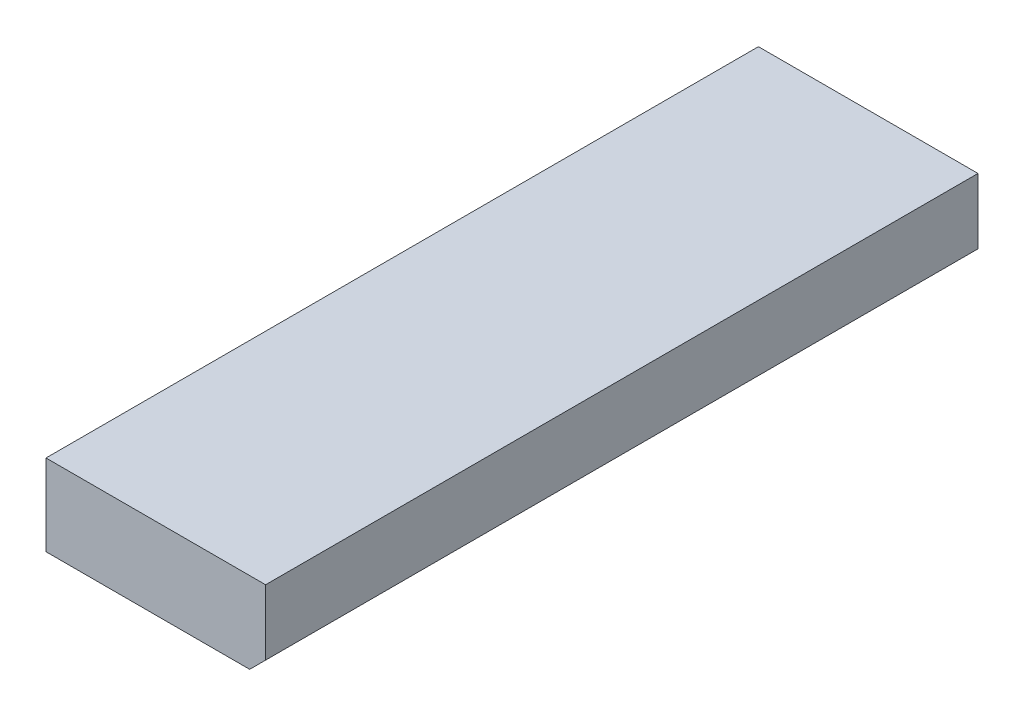
ISO-10303-21;
HEADER;
FILE_DESCRIPTION(('STEP AP214'),'2;1');
FILE_NAME('part.step','',(''),(''),'','','');
FILE_SCHEMA(('AUTOMOTIVE_DESIGN { 1 0 10303 214 1 1 1 1 }'));
ENDSEC;
DATA;
#1=APPLICATION_CONTEXT('core data for automotive mechanical design processes');
#2=APPLICATION_PROTOCOL_DEFINITION('international standard','automotive_design',2000,#1);
#3=PRODUCT_CONTEXT('',#1,'mechanical');
#4=PRODUCT('Part','Part','',(#3));
#5=PRODUCT_RELATED_PRODUCT_CATEGORY('part','',(#4));
#6=PRODUCT_DEFINITION_FORMATION('','',#4);
#7=PRODUCT_DEFINITION_CONTEXT('part definition',#1,'design');
#8=PRODUCT_DEFINITION('design','',#6,#7);
#9=PRODUCT_DEFINITION_SHAPE('','',#8);
#10=(LENGTH_UNIT() NAMED_UNIT(*) SI_UNIT(.MILLI.,.METRE.));
#11=(NAMED_UNIT(*) PLANE_ANGLE_UNIT() SI_UNIT($,.RADIAN.));
#12=(NAMED_UNIT(*) SI_UNIT($,.STERADIAN.) SOLID_ANGLE_UNIT());
#13=UNCERTAINTY_MEASURE_WITH_UNIT(LENGTH_MEASURE(1.E-05),#10,'distance_accuracy_value','');
#14=(GEOMETRIC_REPRESENTATION_CONTEXT(3) GLOBAL_UNCERTAINTY_ASSIGNED_CONTEXT((#13)) GLOBAL_UNIT_ASSIGNED_CONTEXT((#10,
#11,#12)) REPRESENTATION_CONTEXT('',''));
#15=CARTESIAN_POINT('',(0.,0.,0.));
#16=DIRECTION('',(0.,0.,1.));
#17=DIRECTION('',(1.,0.,0.));
#18=AXIS2_PLACEMENT_3D('',#15,#16,#17);
#19=CARTESIAN_POINT('',(0.,0.24375,2.138));
#20=DIRECTION('',(1.,0.,0.));
#21=DIRECTION('',(0.,0.,-1.));
#22=AXIS2_PLACEMENT_3D('',#19,#20,#21);
#23=PLANE('',#22);
#24=DIRECTION('',(0.,-1.,0.));
#25=VECTOR('',#24,1.);
#26=CARTESIAN_POINT('',(0.,0.24375,0.));
#27=LINE('',#26,#25);
#28=CARTESIAN_POINT('',(0.,0.24375,0.));
#29=VERTEX_POINT('',#28);
#30=CARTESIAN_POINT('',(0.,0.,0.));
#31=VERTEX_POINT('',#30);
#32=EDGE_CURVE('E118',#29,#31,#27,.T.);
#33=ORIENTED_EDGE('',*,*,#32,.T.);
#34=DIRECTION('',(0.,0.,-1.));
#35=VECTOR('',#34,1.);
#36=CARTESIAN_POINT('',(0.,0.,2.138));
#37=LINE('',#36,#35);
#38=CARTESIAN_POINT('',(0.,0.,2.138));
#39=VERTEX_POINT('',#38);
#40=EDGE_CURVE('E11',#39,#31,#37,.T.);
#41=ORIENTED_EDGE('',*,*,#40,.F.);
#42=DIRECTION('',(0.,-1.,0.));
#43=VECTOR('',#42,1.);
#44=CARTESIAN_POINT('',(0.,0.24375,2.138));
#45=LINE('',#44,#43);
#46=CARTESIAN_POINT('',(0.,0.24375,2.138));
#47=VERTEX_POINT('',#46);
#48=EDGE_CURVE('E131',#47,#39,#45,.T.);
#49=ORIENTED_EDGE('',*,*,#48,.F.);
#50=DIRECTION('',(0.,0.,-1.));
#51=VECTOR('',#50,1.);
#52=CARTESIAN_POINT('',(0.,0.24375,2.138));
#53=LINE('',#52,#51);
#54=EDGE_CURVE('E114',#47,#29,#53,.T.);
#55=ORIENTED_EDGE('',*,*,#54,.T.);
#56=EDGE_LOOP('',(#33,#41,#49,#55));
#57=FACE_BOUND('',#56,.T.);
#58=ADVANCED_FACE('F39',(#57),#23,.F.);
#59=CARTESIAN_POINT('',(0.,0.,2.138));
#60=DIRECTION('',(0.,1.,0.));
#61=DIRECTION('',(-1.,0.,0.));
#62=AXIS2_PLACEMENT_3D('',#59,#60,#61);
#63=PLANE('',#62);
#64=DIRECTION('',(1.,0.,0.));
#65=VECTOR('',#64,1.);
#66=CARTESIAN_POINT('',(0.,0.,0.));
#67=LINE('',#66,#65);
#68=CARTESIAN_POINT('',(0.61123,0.,0.));
#69=VERTEX_POINT('',#68);
#70=EDGE_CURVE('E122',#31,#69,#67,.T.);
#71=ORIENTED_EDGE('',*,*,#70,.T.);
#72=DIRECTION('',(0.,0.,-1.));
#73=VECTOR('',#72,1.);
#74=CARTESIAN_POINT('',(0.61123,0.,2.138));
#75=LINE('',#74,#73);
#76=CARTESIAN_POINT('',(0.61123,0.,2.138));
#77=VERTEX_POINT('',#76);
#78=EDGE_CURVE('E48',#77,#69,#75,.T.);
#79=ORIENTED_EDGE('',*,*,#78,.F.);
#80=DIRECTION('',(1.,0.,0.));
#81=VECTOR('',#80,1.);
#82=CARTESIAN_POINT('',(0.,0.,2.138));
#83=LINE('',#82,#81);
#84=EDGE_CURVE('E90',#39,#77,#83,.T.);
#85=ORIENTED_EDGE('',*,*,#84,.F.);
#86=ORIENTED_EDGE('',*,*,#40,.T.);
#87=EDGE_LOOP('',(#71,#79,#85,#86));
#88=FACE_BOUND('',#87,.T.);
#89=ADVANCED_FACE('F153',(#88),#63,.F.);
#90=CARTESIAN_POINT('',(0.61123,0.,2.138));
#91=DIRECTION('',(-0.707106781186549,0.707106781186546,0.));
#92=DIRECTION('',(-0.707106781186546,-0.707106781186549,0.));
#93=AXIS2_PLACEMENT_3D('',#90,#91,#92);
#94=PLANE('',#93);
#95=DIRECTION('',(0.707106781186546,0.707106781186549,0.));
#96=VECTOR('',#95,1.);
#97=CARTESIAN_POINT('',(0.61123,0.,0.));
#98=LINE('',#97,#96);
#99=CARTESIAN_POINT('',(0.659,0.0477700000000002,0.));
#100=VERTEX_POINT('',#99);
#101=EDGE_CURVE('E106',#69,#100,#98,.T.);
#102=ORIENTED_EDGE('',*,*,#101,.T.);
#103=DIRECTION('',(0.,0.,-1.));
#104=VECTOR('',#103,1.);
#105=CARTESIAN_POINT('',(0.659,0.0477700000000002,2.138));
#106=LINE('',#105,#104);
#107=CARTESIAN_POINT('',(0.659,0.0477700000000002,2.138));
#108=VERTEX_POINT('',#107);
#109=EDGE_CURVE('E103',#108,#100,#106,.T.);
#110=ORIENTED_EDGE('',*,*,#109,.F.);
#111=DIRECTION('',(0.707106781186546,0.707106781186549,0.));
#112=VECTOR('',#111,1.);
#113=CARTESIAN_POINT('',(0.61123,0.,2.138));
#114=LINE('',#113,#112);
#115=EDGE_CURVE('E94',#77,#108,#114,.T.);
#116=ORIENTED_EDGE('',*,*,#115,.F.);
#117=ORIENTED_EDGE('',*,*,#78,.T.);
#118=EDGE_LOOP('',(#102,#110,#116,#117));
#119=FACE_BOUND('',#118,.T.);
#120=ADVANCED_FACE('F104',(#119),#94,.F.);
#121=CARTESIAN_POINT('',(0.659,0.24375,2.138));
#122=DIRECTION('',(-1.,0.,0.));
#123=DIRECTION('',(0.,0.,1.));
#124=AXIS2_PLACEMENT_3D('',#121,#122,#123);
#125=PLANE('',#124);
#126=DIRECTION('',(0.,1.,0.));
#127=VECTOR('',#126,1.);
#128=CARTESIAN_POINT('',(0.659,0.24375,0.));
#129=LINE('',#128,#127);
#130=CARTESIAN_POINT('',(0.659,0.24375,0.));
#131=VERTEX_POINT('',#130);
#132=EDGE_CURVE('E76',#100,#131,#129,.T.);
#133=ORIENTED_EDGE('',*,*,#132,.T.);
#134=DIRECTION('',(0.,0.,-1.));
#135=VECTOR('',#134,1.);
#136=CARTESIAN_POINT('',(0.659,0.24375,2.138));
#137=LINE('',#136,#135);
#138=CARTESIAN_POINT('',(0.659,0.24375,2.138));
#139=VERTEX_POINT('',#138);
#140=EDGE_CURVE('E108',#139,#131,#137,.T.);
#141=ORIENTED_EDGE('',*,*,#140,.F.);
#142=DIRECTION('',(0.,1.,0.));
#143=VECTOR('',#142,1.);
#144=CARTESIAN_POINT('',(0.659,0.24375,2.138));
#145=LINE('',#144,#143);
#146=EDGE_CURVE('E98',#108,#139,#145,.T.);
#147=ORIENTED_EDGE('',*,*,#146,.F.);
#148=ORIENTED_EDGE('',*,*,#109,.T.);
#149=EDGE_LOOP('',(#133,#141,#147,#148));
#150=FACE_BOUND('',#149,.T.);
#151=ADVANCED_FACE('F110',(#150),#125,.F.);
#152=CARTESIAN_POINT('',(0.,0.24375,2.138));
#153=DIRECTION('',(0.,-1.,0.));
#154=DIRECTION('',(0.,0.,-1.));
#155=AXIS2_PLACEMENT_3D('',#152,#153,#154);
#156=PLANE('',#155);
#157=DIRECTION('',(-1.,0.,0.));
#158=VECTOR('',#157,1.);
#159=CARTESIAN_POINT('',(0.,0.24375,0.));
#160=LINE('',#159,#158);
#161=EDGE_CURVE('E82',#131,#29,#160,.T.);
#162=ORIENTED_EDGE('',*,*,#161,.T.);
#163=ORIENTED_EDGE('',*,*,#54,.F.);
#164=DIRECTION('',(-1.,0.,0.));
#165=VECTOR('',#164,1.);
#166=CARTESIAN_POINT('',(0.,0.24375,2.138));
#167=LINE('',#166,#165);
#168=EDGE_CURVE('E56',#139,#47,#167,.T.);
#169=ORIENTED_EDGE('',*,*,#168,.F.);
#170=ORIENTED_EDGE('',*,*,#140,.T.);
#171=EDGE_LOOP('',(#162,#163,#169,#170));
#172=FACE_BOUND('',#171,.T.);
#173=ADVANCED_FACE('F142',(#172),#156,.F.);
#174=CARTESIAN_POINT('',(0.,0.,2.138));
#175=DIRECTION('',(0.,0.,1.));
#176=DIRECTION('',(1.,0.,0.));
#177=AXIS2_PLACEMENT_3D('',#174,#175,#176);
#178=PLANE('',#177);
#179=ORIENTED_EDGE('',*,*,#48,.T.);
#180=ORIENTED_EDGE('',*,*,#84,.T.);
#181=ORIENTED_EDGE('',*,*,#115,.T.);
#182=ORIENTED_EDGE('',*,*,#146,.T.);
#183=ORIENTED_EDGE('',*,*,#168,.T.);
#184=EDGE_LOOP('',(#179,#180,#181,#182,#183));
#185=FACE_BOUND('',#184,.T.);
#186=ADVANCED_FACE('F96',(#185),#178,.T.);
#187=CARTESIAN_POINT('',(0.,0.,0.));
#188=DIRECTION('',(0.,0.,1.));
#189=DIRECTION('',(1.,0.,0.));
#190=AXIS2_PLACEMENT_3D('',#187,#188,#189);
#191=PLANE('',#190);
#192=ORIENTED_EDGE('',*,*,#32,.F.);
#193=ORIENTED_EDGE('',*,*,#161,.F.);
#194=ORIENTED_EDGE('',*,*,#132,.F.);
#195=ORIENTED_EDGE('',*,*,#101,.F.);
#196=ORIENTED_EDGE('',*,*,#70,.F.);
#197=EDGE_LOOP('',(#192,#193,#194,#195,#196));
#198=FACE_BOUND('',#197,.T.);
#199=ADVANCED_FACE('F138',(#198),#191,.F.);
#200=CLOSED_SHELL('',(#58,#89,#120,#151,#173,#186,#199));
#201=MANIFOLD_SOLID_BREP('B2',#200);
#202=ADVANCED_BREP_SHAPE_REPRESENTATION('',(#18,#201),#14);
#203=SHAPE_DEFINITION_REPRESENTATION(#9,#202);
ENDSEC;
END-ISO-10303-21;
